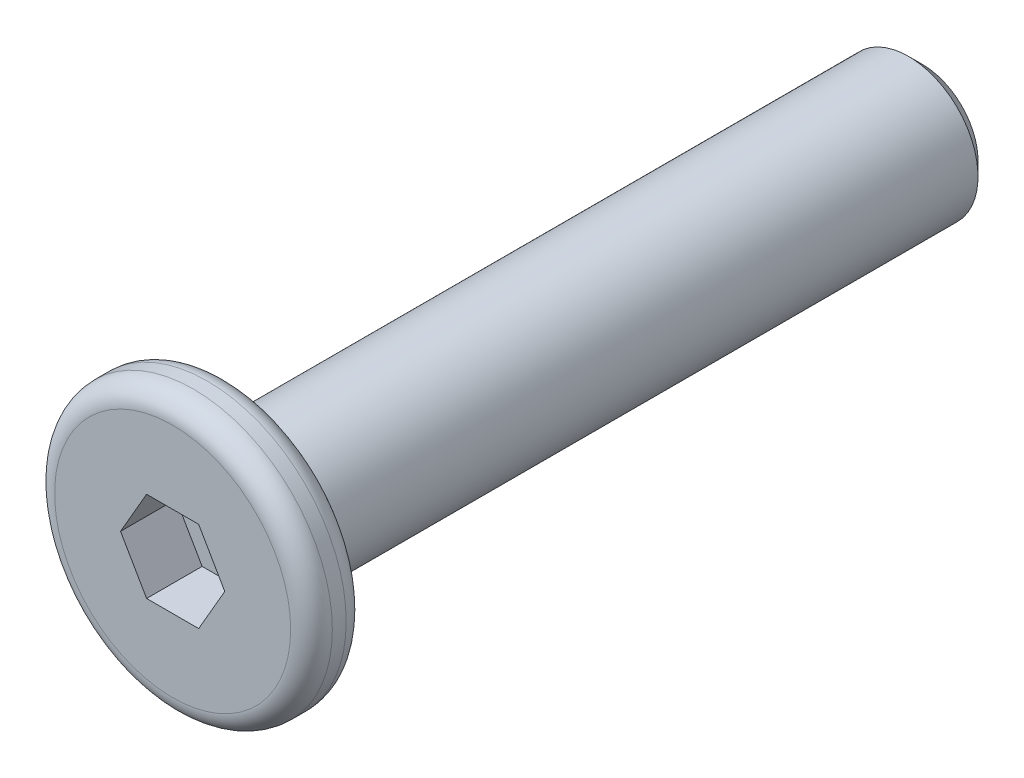
ISO-10303-21;
HEADER;
FILE_DESCRIPTION(('STEP AP214'),'2;1');
FILE_NAME('part.step','',(''),(''),'','','');
FILE_SCHEMA(('AUTOMOTIVE_DESIGN { 1 0 10303 214 1 1 1 1 }'));
ENDSEC;
DATA;
#1=APPLICATION_CONTEXT('core data for automotive mechanical design processes');
#2=APPLICATION_PROTOCOL_DEFINITION('international standard','automotive_design',2000,#1);
#3=PRODUCT_CONTEXT('',#1,'mechanical');
#4=PRODUCT('Part','Part','',(#3));
#5=PRODUCT_RELATED_PRODUCT_CATEGORY('part','',(#4));
#6=PRODUCT_DEFINITION_FORMATION('','',#4);
#7=PRODUCT_DEFINITION_CONTEXT('part definition',#1,'design');
#8=PRODUCT_DEFINITION('design','',#6,#7);
#9=PRODUCT_DEFINITION_SHAPE('','',#8);
#10=(LENGTH_UNIT() NAMED_UNIT(*) SI_UNIT(.MILLI.,.METRE.));
#11=(NAMED_UNIT(*) PLANE_ANGLE_UNIT() SI_UNIT($,.RADIAN.));
#12=(NAMED_UNIT(*) SI_UNIT($,.STERADIAN.) SOLID_ANGLE_UNIT());
#13=UNCERTAINTY_MEASURE_WITH_UNIT(LENGTH_MEASURE(1.E-05),#10,'distance_accuracy_value','');
#14=(GEOMETRIC_REPRESENTATION_CONTEXT(3) GLOBAL_UNCERTAINTY_ASSIGNED_CONTEXT((#13)) GLOBAL_UNIT_ASSIGNED_CONTEXT((#10,
#11,#12)) REPRESENTATION_CONTEXT('',''));
#15=CARTESIAN_POINT('',(0.,0.,0.));
#16=DIRECTION('',(0.,0.,1.));
#17=DIRECTION('',(1.,0.,0.));
#18=AXIS2_PLACEMENT_3D('',#15,#16,#17);
#19=CARTESIAN_POINT('',(0.,0.,0.4));
#20=DIRECTION('',(0.,0.,-1.));
#21=DIRECTION('',(-1.,0.,0.));
#22=AXIS2_PLACEMENT_3D('',#19,#20,#21);
#23=CYLINDRICAL_SURFACE('',#22,2.);
#24=CARTESIAN_POINT('',(0.,0.,-0.1));
#25=DIRECTION('',(0.,0.,1.));
#26=DIRECTION('',(1.,0.,0.));
#27=AXIS2_PLACEMENT_3D('',#24,#25,#26);
#28=CIRCLE('',#27,2.);
#29=CARTESIAN_POINT('',(2.,0.,-0.1));
#30=VERTEX_POINT('',#29);
#31=EDGE_CURVE('E154',#30,#30,#28,.T.);
#32=ORIENTED_EDGE('',*,*,#31,.T.);
#33=EDGE_LOOP('',(#32));
#34=FACE_BOUND('',#33,.T.);
#35=CARTESIAN_POINT('',(0.,0.,0.1));
#36=DIRECTION('',(0.,0.,1.));
#37=DIRECTION('',(1.,0.,0.));
#38=AXIS2_PLACEMENT_3D('',#35,#36,#37);
#39=CIRCLE('',#38,2.);
#40=CARTESIAN_POINT('',(2.,0.,0.1));
#41=VERTEX_POINT('',#40);
#42=EDGE_CURVE('E151',#41,#41,#39,.F.);
#43=ORIENTED_EDGE('',*,*,#42,.T.);
#44=EDGE_LOOP('',(#43));
#45=FACE_BOUND('',#44,.T.);
#46=ADVANCED_FACE('F35',(#34,#45),#23,.T.);
#47=CARTESIAN_POINT('',(0.,0.,0.4));
#48=DIRECTION('',(0.,0.,1.));
#49=DIRECTION('',(1.,0.,0.));
#50=AXIS2_PLACEMENT_3D('',#47,#48,#49);
#51=PLANE('',#50);
#52=CARTESIAN_POINT('',(0.,0.,0.4));
#53=DIRECTION('',(0.,0.,1.));
#54=DIRECTION('',(1.,0.,0.));
#55=AXIS2_PLACEMENT_3D('',#52,#53,#54);
#56=CIRCLE('',#55,1.7);
#57=CARTESIAN_POINT('',(1.7,0.,0.4));
#58=VERTEX_POINT('',#57);
#59=EDGE_CURVE('E11',#58,#58,#56,.T.);
#60=ORIENTED_EDGE('',*,*,#59,.T.);
#61=EDGE_LOOP('',(#60));
#62=FACE_BOUND('',#61,.T.);
#63=DIRECTION('',(0.5,0.866025403784439,0.));
#64=VECTOR('',#63,1.);
#65=CARTESIAN_POINT('',(0.375277674973257,-0.65,0.4));
#66=LINE('',#65,#64);
#67=CARTESIAN_POINT('',(0.375277674973257,-0.65,0.4));
#68=VERTEX_POINT('',#67);
#69=CARTESIAN_POINT('',(0.750555349946514,0.,0.4));
#70=VERTEX_POINT('',#69);
#71=EDGE_CURVE('E50',#68,#70,#66,.T.);
#72=ORIENTED_EDGE('',*,*,#71,.F.);
#73=DIRECTION('',(1.,0.,0.));
#74=VECTOR('',#73,1.);
#75=CARTESIAN_POINT('',(-0.375277674973256,-0.65,0.4));
#76=LINE('',#75,#74);
#77=CARTESIAN_POINT('',(-0.375277674973256,-0.65,0.4));
#78=VERTEX_POINT('',#77);
#79=EDGE_CURVE('E133',#78,#68,#76,.T.);
#80=ORIENTED_EDGE('',*,*,#79,.F.);
#81=DIRECTION('',(0.5,-0.866025403784438,0.));
#82=VECTOR('',#81,1.);
#83=CARTESIAN_POINT('',(-0.750555349946513,0.,0.4));
#84=LINE('',#83,#82);
#85=CARTESIAN_POINT('',(-0.750555349946513,0.,0.4));
#86=VERTEX_POINT('',#85);
#87=EDGE_CURVE('E131',#86,#78,#84,.T.);
#88=ORIENTED_EDGE('',*,*,#87,.F.);
#89=DIRECTION('',(-0.5,-0.866025403784439,0.));
#90=VECTOR('',#89,1.);
#91=CARTESIAN_POINT('',(-0.375277674973257,0.65,0.4));
#92=LINE('',#91,#90);
#93=CARTESIAN_POINT('',(-0.375277674973257,0.65,0.4));
#94=VERTEX_POINT('',#93);
#95=EDGE_CURVE('E98',#94,#86,#92,.T.);
#96=ORIENTED_EDGE('',*,*,#95,.F.);
#97=DIRECTION('',(-1.,0.,0.));
#98=VECTOR('',#97,1.);
#99=CARTESIAN_POINT('',(0.375277674973257,0.65,0.4));
#100=LINE('',#99,#98);
#101=CARTESIAN_POINT('',(0.375277674973257,0.65,0.4));
#102=VERTEX_POINT('',#101);
#103=EDGE_CURVE('E127',#102,#94,#100,.T.);
#104=ORIENTED_EDGE('',*,*,#103,.F.);
#105=DIRECTION('',(-0.5,0.866025403784439,0.));
#106=VECTOR('',#105,1.);
#107=CARTESIAN_POINT('',(0.750555349946514,0.,0.4));
#108=LINE('',#107,#106);
#109=EDGE_CURVE('E124',#70,#102,#108,.T.);
#110=ORIENTED_EDGE('',*,*,#109,.F.);
#111=EDGE_LOOP('',(#72,#80,#88,#96,#104,#110));
#112=FACE_BOUND('',#111,.T.);
#113=ADVANCED_FACE('F169',(#62,#112),#51,.T.);
#114=CARTESIAN_POINT('',(0.,0.,-0.4));
#115=DIRECTION('',(0.,0.,1.));
#116=DIRECTION('',(1.,0.,0.));
#117=AXIS2_PLACEMENT_3D('',#114,#115,#116);
#118=PLANE('',#117);
#119=CARTESIAN_POINT('',(0.,0.,-0.4));
#120=DIRECTION('',(0.,0.,1.));
#121=DIRECTION('',(1.,0.,0.));
#122=AXIS2_PLACEMENT_3D('',#119,#120,#121);
#123=CIRCLE('',#122,1.7);
#124=CARTESIAN_POINT('',(1.7,0.,-0.4));
#125=VERTEX_POINT('',#124);
#126=EDGE_CURVE('E43',#125,#125,#123,.F.);
#127=ORIENTED_EDGE('',*,*,#126,.T.);
#128=EDGE_LOOP('',(#127));
#129=FACE_BOUND('',#128,.T.);
#130=CARTESIAN_POINT('',(0.,0.,-0.4));
#131=DIRECTION('',(0.,0.,-1.));
#132=DIRECTION('',(-1.,0.,0.));
#133=AXIS2_PLACEMENT_3D('',#130,#131,#132);
#134=CIRCLE('',#133,1.);
#135=CARTESIAN_POINT('',(-1.,0.,-0.4));
#136=VERTEX_POINT('',#135);
#137=EDGE_CURVE('E137',#136,#136,#134,.T.);
#138=ORIENTED_EDGE('',*,*,#137,.F.);
#139=EDGE_LOOP('',(#138));
#140=FACE_BOUND('',#139,.T.);
#141=ADVANCED_FACE('F159',(#129,#140),#118,.F.);
#142=CARTESIAN_POINT('',(0.,0.,-10.4));
#143=DIRECTION('',(0.,0.,1.));
#144=DIRECTION('',(1.,0.,0.));
#145=AXIS2_PLACEMENT_3D('',#142,#143,#144);
#146=CYLINDRICAL_SURFACE('',#145,1.);
#147=CARTESIAN_POINT('',(0.,0.,-10.2));
#148=DIRECTION('',(0.,0.,-1.));
#149=DIRECTION('',(-1.,0.,0.));
#150=AXIS2_PLACEMENT_3D('',#147,#148,#149);
#151=CIRCLE('',#150,1.);
#152=CARTESIAN_POINT('',(-1.,0.,-10.2));
#153=VERTEX_POINT('',#152);
#154=EDGE_CURVE('E148',#153,#153,#151,.F.);
#155=ORIENTED_EDGE('',*,*,#154,.T.);
#156=EDGE_LOOP('',(#155));
#157=FACE_BOUND('',#156,.T.);
#158=ORIENTED_EDGE('',*,*,#137,.T.);
#159=EDGE_LOOP('',(#158));
#160=FACE_BOUND('',#159,.T.);
#161=ADVANCED_FACE('F204',(#157,#160),#146,.T.);
#162=CARTESIAN_POINT('',(0.,0.,-10.4));
#163=DIRECTION('',(0.,0.,-1.));
#164=DIRECTION('',(-1.,0.,0.));
#165=AXIS2_PLACEMENT_3D('',#162,#163,#164);
#166=PLANE('',#165);
#167=CARTESIAN_POINT('',(0.,0.,-10.4));
#168=DIRECTION('',(0.,0.,-1.));
#169=DIRECTION('',(-1.,0.,0.));
#170=AXIS2_PLACEMENT_3D('',#167,#168,#169);
#171=CIRCLE('',#170,0.8);
#172=CARTESIAN_POINT('',(-0.8,0.,-10.4));
#173=VERTEX_POINT('',#172);
#174=EDGE_CURVE('E145',#173,#173,#171,.T.);
#175=ORIENTED_EDGE('',*,*,#174,.T.);
#176=EDGE_LOOP('',(#175));
#177=FACE_BOUND('',#176,.T.);
#178=ADVANCED_FACE('F196',(#177),#166,.T.);
#179=CARTESIAN_POINT('',(0.,0.,-10.4));
#180=DIRECTION('',(0.,0.,1.));
#181=DIRECTION('',(1.,0.,0.));
#182=AXIS2_PLACEMENT_3D('',#179,#180,#181);
#183=CONICAL_SURFACE('',#182,0.8,0.785398163397446);
#184=ORIENTED_EDGE('',*,*,#154,.F.);
#185=EDGE_LOOP('',(#184));
#186=FACE_BOUND('',#185,.T.);
#187=ORIENTED_EDGE('',*,*,#174,.F.);
#188=EDGE_LOOP('',(#187));
#189=FACE_BOUND('',#188,.T.);
#190=ADVANCED_FACE('F189',(#186,#189),#183,.T.);
#191=CARTESIAN_POINT('',(0.375277674973257,-0.65,-0.4));
#192=DIRECTION('',(0.866025403784439,-0.5,0.));
#193=DIRECTION('',(0.5,0.866025403784439,0.));
#194=AXIS2_PLACEMENT_3D('',#191,#192,#193);
#195=PLANE('',#194);
#196=ORIENTED_EDGE('',*,*,#71,.T.);
#197=DIRECTION('',(0.,0.,1.));
#198=VECTOR('',#197,1.);
#199=CARTESIAN_POINT('',(0.750555349946514,0.,-0.4));
#200=LINE('',#199,#198);
#201=CARTESIAN_POINT('',(0.750555349946514,0.,-0.4));
#202=VERTEX_POINT('',#201);
#203=EDGE_CURVE('E80',#202,#70,#200,.T.);
#204=ORIENTED_EDGE('',*,*,#203,.F.);
#205=DIRECTION('',(0.5,0.866025403784439,0.));
#206=VECTOR('',#205,1.);
#207=CARTESIAN_POINT('',(0.375277674973257,-0.65,-0.4));
#208=LINE('',#207,#206);
#209=CARTESIAN_POINT('',(0.375277674973257,-0.65,-0.4));
#210=VERTEX_POINT('',#209);
#211=EDGE_CURVE('E135',#210,#202,#208,.T.);
#212=ORIENTED_EDGE('',*,*,#211,.F.);
#213=DIRECTION('',(0.,0.,1.));
#214=VECTOR('',#213,1.);
#215=CARTESIAN_POINT('',(0.375277674973257,-0.65,-0.4));
#216=LINE('',#215,#214);
#217=EDGE_CURVE('E58',#210,#68,#216,.T.);
#218=ORIENTED_EDGE('',*,*,#217,.T.);
#219=EDGE_LOOP('',(#196,#204,#212,#218));
#220=FACE_BOUND('',#219,.T.);
#221=ADVANCED_FACE('F186',(#220),#195,.F.);
#222=CARTESIAN_POINT('',(-0.375277674973256,-0.65,-0.4));
#223=DIRECTION('',(0.,-1.,0.));
#224=DIRECTION('',(1.,0.,0.));
#225=AXIS2_PLACEMENT_3D('',#222,#223,#224);
#226=PLANE('',#225);
#227=ORIENTED_EDGE('',*,*,#79,.T.);
#228=ORIENTED_EDGE('',*,*,#217,.F.);
#229=DIRECTION('',(1.,0.,0.));
#230=VECTOR('',#229,1.);
#231=CARTESIAN_POINT('',(-0.375277674973256,-0.65,-0.4));
#232=LINE('',#231,#230);
#233=CARTESIAN_POINT('',(-0.375277674973256,-0.65,-0.4));
#234=VERTEX_POINT('',#233);
#235=EDGE_CURVE('E110',#234,#210,#232,.T.);
#236=ORIENTED_EDGE('',*,*,#235,.F.);
#237=DIRECTION('',(0.,0.,1.));
#238=VECTOR('',#237,1.);
#239=CARTESIAN_POINT('',(-0.375277674973256,-0.65,-0.4));
#240=LINE('',#239,#238);
#241=EDGE_CURVE('E102',#234,#78,#240,.T.);
#242=ORIENTED_EDGE('',*,*,#241,.T.);
#243=EDGE_LOOP('',(#227,#228,#236,#242));
#244=FACE_BOUND('',#243,.T.);
#245=ADVANCED_FACE('F188',(#244),#226,.F.);
#246=CARTESIAN_POINT('',(-0.750555349946513,0.,-0.4));
#247=DIRECTION('',(-0.866025403784438,-0.5,0.));
#248=DIRECTION('',(0.5,-0.866025403784439,0.));
#249=AXIS2_PLACEMENT_3D('',#246,#247,#248);
#250=PLANE('',#249);
#251=ORIENTED_EDGE('',*,*,#87,.T.);
#252=ORIENTED_EDGE('',*,*,#241,.F.);
#253=DIRECTION('',(0.5,-0.866025403784438,0.));
#254=VECTOR('',#253,1.);
#255=CARTESIAN_POINT('',(-0.750555349946513,0.,-0.4));
#256=LINE('',#255,#254);
#257=CARTESIAN_POINT('',(-0.750555349946513,0.,-0.4));
#258=VERTEX_POINT('',#257);
#259=EDGE_CURVE('E106',#258,#234,#256,.T.);
#260=ORIENTED_EDGE('',*,*,#259,.F.);
#261=DIRECTION('',(0.,0.,1.));
#262=VECTOR('',#261,1.);
#263=CARTESIAN_POINT('',(-0.750555349946513,0.,-0.4));
#264=LINE('',#263,#262);
#265=EDGE_CURVE('E91',#258,#86,#264,.T.);
#266=ORIENTED_EDGE('',*,*,#265,.T.);
#267=EDGE_LOOP('',(#251,#252,#260,#266));
#268=FACE_BOUND('',#267,.T.);
#269=ADVANCED_FACE('F107',(#268),#250,.F.);
#270=CARTESIAN_POINT('',(-0.375277674973257,0.65,-0.4));
#271=DIRECTION('',(-0.866025403784439,0.5,0.));
#272=DIRECTION('',(-0.5,-0.866025403784439,0.));
#273=AXIS2_PLACEMENT_3D('',#270,#271,#272);
#274=PLANE('',#273);
#275=ORIENTED_EDGE('',*,*,#95,.T.);
#276=ORIENTED_EDGE('',*,*,#265,.F.);
#277=DIRECTION('',(-0.5,-0.866025403784439,0.));
#278=VECTOR('',#277,1.);
#279=CARTESIAN_POINT('',(-0.375277674973257,0.65,-0.4));
#280=LINE('',#279,#278);
#281=CARTESIAN_POINT('',(-0.375277674973257,0.65,-0.4));
#282=VERTEX_POINT('',#281);
#283=EDGE_CURVE('E95',#282,#258,#280,.T.);
#284=ORIENTED_EDGE('',*,*,#283,.F.);
#285=DIRECTION('',(0.,0.,1.));
#286=VECTOR('',#285,1.);
#287=CARTESIAN_POINT('',(-0.375277674973257,0.65,-0.4));
#288=LINE('',#287,#286);
#289=EDGE_CURVE('E103',#282,#94,#288,.T.);
#290=ORIENTED_EDGE('',*,*,#289,.T.);
#291=EDGE_LOOP('',(#275,#276,#284,#290));
#292=FACE_BOUND('',#291,.T.);
#293=ADVANCED_FACE('F93',(#292),#274,.F.);
#294=CARTESIAN_POINT('',(0.375277674973257,0.65,-0.4));
#295=DIRECTION('',(0.,1.,0.));
#296=DIRECTION('',(0.,0.,1.));
#297=AXIS2_PLACEMENT_3D('',#294,#295,#296);
#298=PLANE('',#297);
#299=ORIENTED_EDGE('',*,*,#103,.T.);
#300=ORIENTED_EDGE('',*,*,#289,.F.);
#301=DIRECTION('',(-1.,0.,0.));
#302=VECTOR('',#301,1.);
#303=CARTESIAN_POINT('',(0.375277674973257,0.65,-0.4));
#304=LINE('',#303,#302);
#305=CARTESIAN_POINT('',(0.375277674973257,0.65,-0.4));
#306=VERTEX_POINT('',#305);
#307=EDGE_CURVE('E116',#306,#282,#304,.T.);
#308=ORIENTED_EDGE('',*,*,#307,.F.);
#309=DIRECTION('',(0.,0.,1.));
#310=VECTOR('',#309,1.);
#311=CARTESIAN_POINT('',(0.375277674973257,0.65,-0.4));
#312=LINE('',#311,#310);
#313=EDGE_CURVE('E140',#306,#102,#312,.T.);
#314=ORIENTED_EDGE('',*,*,#313,.T.);
#315=EDGE_LOOP('',(#299,#300,#308,#314));
#316=FACE_BOUND('',#315,.T.);
#317=ADVANCED_FACE('F257',(#316),#298,.F.);
#318=CARTESIAN_POINT('',(0.750555349946514,0.,-0.4));
#319=DIRECTION('',(0.866025403784439,0.5,0.));
#320=DIRECTION('',(-0.5,0.866025403784439,0.));
#321=AXIS2_PLACEMENT_3D('',#318,#319,#320);
#322=PLANE('',#321);
#323=ORIENTED_EDGE('',*,*,#109,.T.);
#324=ORIENTED_EDGE('',*,*,#313,.F.);
#325=DIRECTION('',(-0.5,0.866025403784439,0.));
#326=VECTOR('',#325,1.);
#327=CARTESIAN_POINT('',(0.750555349946514,0.,-0.4));
#328=LINE('',#327,#326);
#329=EDGE_CURVE('E118',#202,#306,#328,.T.);
#330=ORIENTED_EDGE('',*,*,#329,.F.);
#331=ORIENTED_EDGE('',*,*,#203,.T.);
#332=EDGE_LOOP('',(#323,#324,#330,#331));
#333=FACE_BOUND('',#332,.T.);
#334=ADVANCED_FACE('F184',(#333),#322,.F.);
#335=CARTESIAN_POINT('',(0.,0.,-0.4));
#336=DIRECTION('',(0.,0.,1.));
#337=DIRECTION('',(1.,0.,0.));
#338=AXIS2_PLACEMENT_3D('',#335,#336,#337);
#339=PLANE('',#338);
#340=ORIENTED_EDGE('',*,*,#211,.T.);
#341=ORIENTED_EDGE('',*,*,#329,.T.);
#342=ORIENTED_EDGE('',*,*,#307,.T.);
#343=ORIENTED_EDGE('',*,*,#283,.T.);
#344=ORIENTED_EDGE('',*,*,#259,.T.);
#345=ORIENTED_EDGE('',*,*,#235,.T.);
#346=EDGE_LOOP('',(#340,#341,#342,#343,#344,#345));
#347=FACE_BOUND('',#346,.T.);
#348=ADVANCED_FACE('F113',(#347),#339,.T.);
#349=CARTESIAN_POINT('',(0.,0.,-0.1));
#350=DIRECTION('',(0.,0.,1.));
#351=DIRECTION('',(1.,0.,0.));
#352=AXIS2_PLACEMENT_3D('',#349,#350,#351);
#353=TOROIDAL_SURFACE('',#352,1.7,0.3);
#354=ORIENTED_EDGE('',*,*,#126,.F.);
#355=EDGE_LOOP('',(#354));
#356=FACE_BOUND('',#355,.T.);
#357=ORIENTED_EDGE('',*,*,#31,.F.);
#358=EDGE_LOOP('',(#357));
#359=FACE_BOUND('',#358,.T.);
#360=ADVANCED_FACE('F162',(#356,#359),#353,.T.);
#361=CARTESIAN_POINT('',(0.,0.,0.1));
#362=DIRECTION('',(0.,0.,1.));
#363=DIRECTION('',(1.,0.,0.));
#364=AXIS2_PLACEMENT_3D('',#361,#362,#363);
#365=TOROIDAL_SURFACE('',#364,1.7,0.3);
#366=ORIENTED_EDGE('',*,*,#42,.F.);
#367=EDGE_LOOP('',(#366));
#368=FACE_BOUND('',#367,.T.);
#369=ORIENTED_EDGE('',*,*,#59,.F.);
#370=EDGE_LOOP('',(#369));
#371=FACE_BOUND('',#370,.T.);
#372=ADVANCED_FACE('F37',(#368,#371),#365,.T.);
#373=CLOSED_SHELL('',(#46,#113,#141,#161,#178,#190,#221,#245,#269,#293,#317,#334,#348,#360,#372));
#374=MANIFOLD_SOLID_BREP('B2',#373);
#375=ADVANCED_BREP_SHAPE_REPRESENTATION('',(#18,#374),#14);
#376=SHAPE_DEFINITION_REPRESENTATION(#9,#375);
ENDSEC;
END-ISO-10303-21;
